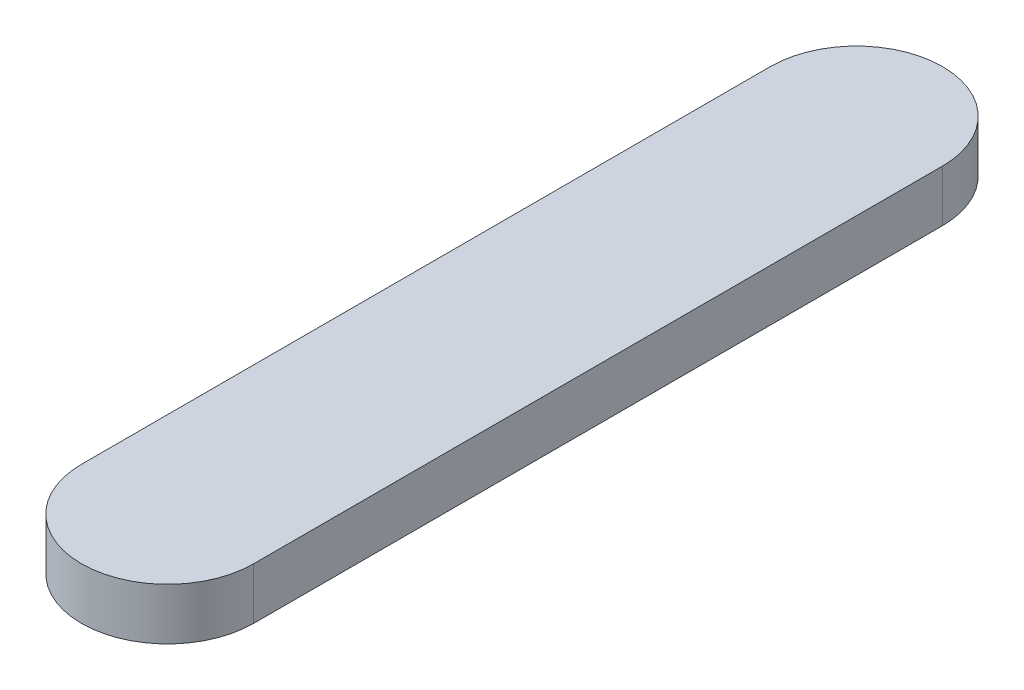
ISO-10303-21;
HEADER;
FILE_DESCRIPTION(('STEP AP214'),'2;1');
FILE_NAME('part.step','',(''),(''),'','','');
FILE_SCHEMA(('AUTOMOTIVE_DESIGN { 1 0 10303 214 1 1 1 1 }'));
ENDSEC;
DATA;
#1=APPLICATION_CONTEXT('core data for automotive mechanical design processes');
#2=APPLICATION_PROTOCOL_DEFINITION('international standard','automotive_design',2000,#1);
#3=PRODUCT_CONTEXT('',#1,'mechanical');
#4=PRODUCT('Part','Part','',(#3));
#5=PRODUCT_RELATED_PRODUCT_CATEGORY('part','',(#4));
#6=PRODUCT_DEFINITION_FORMATION('','',#4);
#7=PRODUCT_DEFINITION_CONTEXT('part definition',#1,'design');
#8=PRODUCT_DEFINITION('design','',#6,#7);
#9=PRODUCT_DEFINITION_SHAPE('','',#8);
#10=(LENGTH_UNIT() NAMED_UNIT(*) SI_UNIT(.MILLI.,.METRE.));
#11=(NAMED_UNIT(*) PLANE_ANGLE_UNIT() SI_UNIT($,.RADIAN.));
#12=(NAMED_UNIT(*) SI_UNIT($,.STERADIAN.) SOLID_ANGLE_UNIT());
#13=UNCERTAINTY_MEASURE_WITH_UNIT(LENGTH_MEASURE(1.E-05),#10,'distance_accuracy_value','');
#14=(GEOMETRIC_REPRESENTATION_CONTEXT(3) GLOBAL_UNCERTAINTY_ASSIGNED_CONTEXT((#13)) GLOBAL_UNIT_ASSIGNED_CONTEXT((#10,
#11,#12)) REPRESENTATION_CONTEXT('',''));
#15=CARTESIAN_POINT('',(0.,0.,0.));
#16=DIRECTION('',(0.,0.,1.));
#17=DIRECTION('',(1.,0.,0.));
#18=AXIS2_PLACEMENT_3D('',#15,#16,#17);
#19=CARTESIAN_POINT('',(0.,30.,-200.));
#20=DIRECTION('',(0.,-1.,0.));
#21=DIRECTION('',(0.,0.,-1.));
#22=AXIS2_PLACEMENT_3D('',#19,#20,#21);
#23=CYLINDRICAL_SURFACE('',#22,50.);
#24=CARTESIAN_POINT('',(0.,0.,-200.));
#25=DIRECTION('',(0.,1.,0.));
#26=DIRECTION('',(0.,0.,1.));
#27=AXIS2_PLACEMENT_3D('',#24,#25,#26);
#28=CIRCLE('',#27,50.);
#29=CARTESIAN_POINT('',(49.9999999999999,0.,-200.));
#30=VERTEX_POINT('',#29);
#31=CARTESIAN_POINT('',(-50.0000000000001,0.,-200.));
#32=VERTEX_POINT('',#31);
#33=EDGE_CURVE('E104',#30,#32,#28,.T.);
#34=ORIENTED_EDGE('',*,*,#33,.T.);
#35=DIRECTION('',(0.,-1.,0.));
#36=VECTOR('',#35,1.);
#37=CARTESIAN_POINT('',(-50.0000000000001,30.,-200.));
#38=LINE('',#37,#36);
#39=CARTESIAN_POINT('',(-50.0000000000001,30.,-200.));
#40=VERTEX_POINT('',#39);
#41=EDGE_CURVE('E11',#40,#32,#38,.T.);
#42=ORIENTED_EDGE('',*,*,#41,.F.);
#43=CARTESIAN_POINT('',(0.,30.,-200.));
#44=DIRECTION('',(0.,1.,0.));
#45=DIRECTION('',(0.,0.,1.));
#46=AXIS2_PLACEMENT_3D('',#43,#44,#45);
#47=CIRCLE('',#46,50.);
#48=CARTESIAN_POINT('',(49.9999999999999,30.,-200.));
#49=VERTEX_POINT('',#48);
#50=EDGE_CURVE('E92',#49,#40,#47,.T.);
#51=ORIENTED_EDGE('',*,*,#50,.F.);
#52=DIRECTION('',(0.,-1.,0.));
#53=VECTOR('',#52,1.);
#54=CARTESIAN_POINT('',(49.9999999999999,30.,-200.));
#55=LINE('',#54,#53);
#56=EDGE_CURVE('E100',#49,#30,#55,.T.);
#57=ORIENTED_EDGE('',*,*,#56,.T.);
#58=EDGE_LOOP('',(#34,#42,#51,#57));
#59=FACE_BOUND('',#58,.T.);
#60=ADVANCED_FACE('F41',(#59),#23,.T.);
#61=CARTESIAN_POINT('',(-50.0000000000001,30.,-200.));
#62=DIRECTION('',(1.,0.,0.));
#63=DIRECTION('',(0.,0.,-1.));
#64=AXIS2_PLACEMENT_3D('',#61,#62,#63);
#65=PLANE('',#64);
#66=DIRECTION('',(0.,0.,1.));
#67=VECTOR('',#66,1.);
#68=CARTESIAN_POINT('',(-50.0000000000001,0.,-200.));
#69=LINE('',#68,#67);
#70=CARTESIAN_POINT('',(-50.,0.,200.));
#71=VERTEX_POINT('',#70);
#72=EDGE_CURVE('E96',#32,#71,#69,.T.);
#73=ORIENTED_EDGE('',*,*,#72,.T.);
#74=DIRECTION('',(0.,-1.,0.));
#75=VECTOR('',#74,1.);
#76=CARTESIAN_POINT('',(-50.,30.,200.));
#77=LINE('',#76,#75);
#78=CARTESIAN_POINT('',(-50.,30.,200.));
#79=VERTEX_POINT('',#78);
#80=EDGE_CURVE('E49',#79,#71,#77,.T.);
#81=ORIENTED_EDGE('',*,*,#80,.F.);
#82=DIRECTION('',(0.,0.,1.));
#83=VECTOR('',#82,1.);
#84=CARTESIAN_POINT('',(-50.0000000000001,30.,-200.));
#85=LINE('',#84,#83);
#86=EDGE_CURVE('E87',#40,#79,#85,.T.);
#87=ORIENTED_EDGE('',*,*,#86,.F.);
#88=ORIENTED_EDGE('',*,*,#41,.T.);
#89=EDGE_LOOP('',(#73,#81,#87,#88));
#90=FACE_BOUND('',#89,.T.);
#91=ADVANCED_FACE('F95',(#90),#65,.F.);
#92=CARTESIAN_POINT('',(0.,30.,200.));
#93=DIRECTION('',(0.,-1.,0.));
#94=DIRECTION('',(0.,0.,-1.));
#95=AXIS2_PLACEMENT_3D('',#92,#93,#94);
#96=CYLINDRICAL_SURFACE('',#95,50.);
#97=CARTESIAN_POINT('',(0.,0.,200.));
#98=DIRECTION('',(0.,1.,0.));
#99=DIRECTION('',(0.,0.,1.));
#100=AXIS2_PLACEMENT_3D('',#97,#98,#99);
#101=CIRCLE('',#100,50.);
#102=CARTESIAN_POINT('',(50.,0.,200.));
#103=VERTEX_POINT('',#102);
#104=EDGE_CURVE('E74',#71,#103,#101,.T.);
#105=ORIENTED_EDGE('',*,*,#104,.T.);
#106=DIRECTION('',(0.,-1.,0.));
#107=VECTOR('',#106,1.);
#108=CARTESIAN_POINT('',(50.,30.,200.));
#109=LINE('',#108,#107);
#110=CARTESIAN_POINT('',(50.,30.,200.));
#111=VERTEX_POINT('',#110);
#112=EDGE_CURVE('E97',#111,#103,#109,.T.);
#113=ORIENTED_EDGE('',*,*,#112,.F.);
#114=CARTESIAN_POINT('',(0.,30.,200.));
#115=DIRECTION('',(0.,1.,0.));
#116=DIRECTION('',(0.,0.,1.));
#117=AXIS2_PLACEMENT_3D('',#114,#115,#116);
#118=CIRCLE('',#117,50.);
#119=EDGE_CURVE('E90',#79,#111,#118,.T.);
#120=ORIENTED_EDGE('',*,*,#119,.F.);
#121=ORIENTED_EDGE('',*,*,#80,.T.);
#122=EDGE_LOOP('',(#105,#113,#120,#121));
#123=FACE_BOUND('',#122,.T.);
#124=ADVANCED_FACE('F98',(#123),#96,.T.);
#125=CARTESIAN_POINT('',(49.9999999999999,30.,-200.));
#126=DIRECTION('',(-1.,0.,0.));
#127=DIRECTION('',(0.,0.,1.));
#128=AXIS2_PLACEMENT_3D('',#125,#126,#127);
#129=PLANE('',#128);
#130=DIRECTION('',(0.,0.,-1.));
#131=VECTOR('',#130,1.);
#132=CARTESIAN_POINT('',(49.9999999999999,0.,-200.));
#133=LINE('',#132,#131);
#134=EDGE_CURVE('E80',#103,#30,#133,.T.);
#135=ORIENTED_EDGE('',*,*,#134,.T.);
#136=ORIENTED_EDGE('',*,*,#56,.F.);
#137=DIRECTION('',(0.,0.,-1.));
#138=VECTOR('',#137,1.);
#139=CARTESIAN_POINT('',(49.9999999999999,30.,-200.));
#140=LINE('',#139,#138);
#141=EDGE_CURVE('E57',#111,#49,#140,.T.);
#142=ORIENTED_EDGE('',*,*,#141,.F.);
#143=ORIENTED_EDGE('',*,*,#112,.T.);
#144=EDGE_LOOP('',(#135,#136,#142,#143));
#145=FACE_BOUND('',#144,.T.);
#146=ADVANCED_FACE('F111',(#145),#129,.F.);
#147=CARTESIAN_POINT('',(0.,30.,-200.));
#148=DIRECTION('',(0.,1.,0.));
#149=DIRECTION('',(0.,0.,1.));
#150=AXIS2_PLACEMENT_3D('',#147,#148,#149);
#151=PLANE('',#150);
#152=ORIENTED_EDGE('',*,*,#50,.T.);
#153=ORIENTED_EDGE('',*,*,#86,.T.);
#154=ORIENTED_EDGE('',*,*,#119,.T.);
#155=ORIENTED_EDGE('',*,*,#141,.T.);
#156=EDGE_LOOP('',(#152,#153,#154,#155));
#157=FACE_BOUND('',#156,.T.);
#158=ADVANCED_FACE('F88',(#157),#151,.T.);
#159=CARTESIAN_POINT('',(0.,0.,-200.));
#160=DIRECTION('',(0.,1.,0.));
#161=DIRECTION('',(0.,0.,1.));
#162=AXIS2_PLACEMENT_3D('',#159,#160,#161);
#163=PLANE('',#162);
#164=ORIENTED_EDGE('',*,*,#33,.F.);
#165=ORIENTED_EDGE('',*,*,#134,.F.);
#166=ORIENTED_EDGE('',*,*,#104,.F.);
#167=ORIENTED_EDGE('',*,*,#72,.F.);
#168=EDGE_LOOP('',(#164,#165,#166,#167));
#169=FACE_BOUND('',#168,.T.);
#170=ADVANCED_FACE('F114',(#169),#163,.F.);
#171=CLOSED_SHELL('',(#60,#91,#124,#146,#158,#170));
#172=MANIFOLD_SOLID_BREP('B2',#171);
#173=ADVANCED_BREP_SHAPE_REPRESENTATION('',(#18,#172),#14);
#174=SHAPE_DEFINITION_REPRESENTATION(#9,#173);
ENDSEC;
END-ISO-10303-21;
